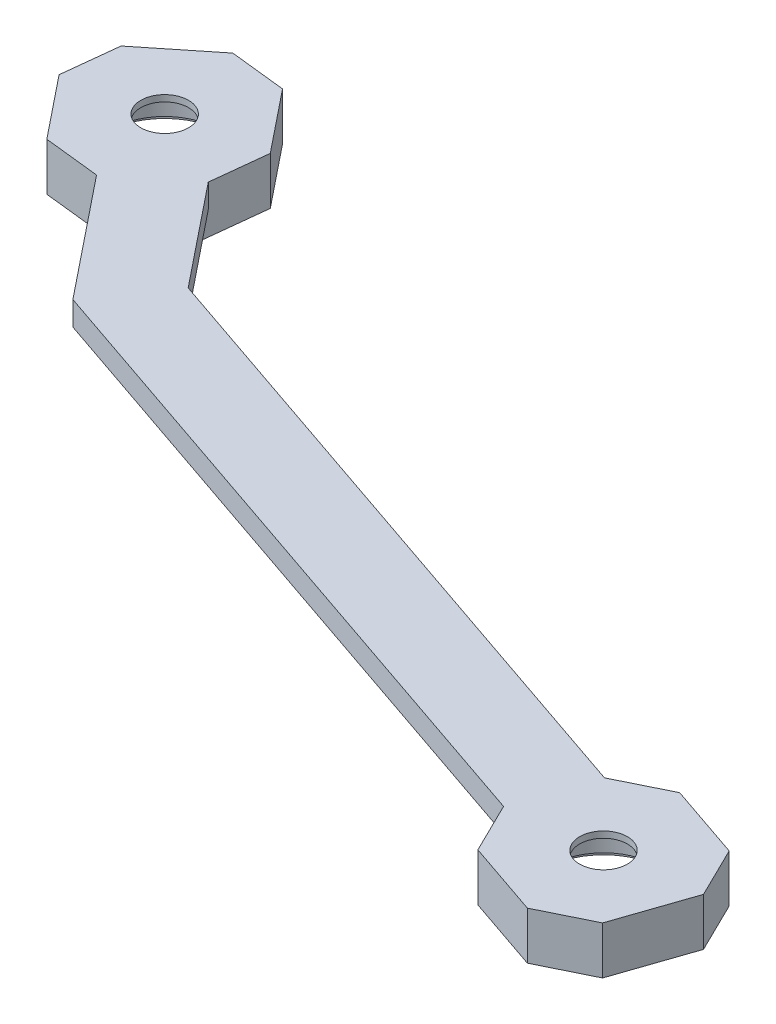
ISO-10303-21;
HEADER;
FILE_DESCRIPTION(('STEP AP214'),'2;1');
FILE_NAME('part.step','',(''),(''),'','','');
FILE_SCHEMA(('AUTOMOTIVE_DESIGN { 1 0 10303 214 1 1 1 1 }'));
ENDSEC;
DATA;
#1=APPLICATION_CONTEXT('core data for automotive mechanical design processes');
#2=APPLICATION_PROTOCOL_DEFINITION('international standard','automotive_design',2000,#1);
#3=PRODUCT_CONTEXT('',#1,'mechanical');
#4=PRODUCT('Part','Part','',(#3));
#5=PRODUCT_RELATED_PRODUCT_CATEGORY('part','',(#4));
#6=PRODUCT_DEFINITION_FORMATION('','',#4);
#7=PRODUCT_DEFINITION_CONTEXT('part definition',#1,'design');
#8=PRODUCT_DEFINITION('design','',#6,#7);
#9=PRODUCT_DEFINITION_SHAPE('','',#8);
#10=(LENGTH_UNIT() NAMED_UNIT(*) SI_UNIT(.MILLI.,.METRE.));
#11=(NAMED_UNIT(*) PLANE_ANGLE_UNIT() SI_UNIT($,.RADIAN.));
#12=(NAMED_UNIT(*) SI_UNIT($,.STERADIAN.) SOLID_ANGLE_UNIT());
#13=UNCERTAINTY_MEASURE_WITH_UNIT(LENGTH_MEASURE(1.E-05),#10,'distance_accuracy_value','');
#14=(GEOMETRIC_REPRESENTATION_CONTEXT(3) GLOBAL_UNCERTAINTY_ASSIGNED_CONTEXT((#13)) GLOBAL_UNIT_ASSIGNED_CONTEXT((#10,
#11,#12)) REPRESENTATION_CONTEXT('',''));
#15=CARTESIAN_POINT('',(0.,0.,0.));
#16=DIRECTION('',(0.,0.,1.));
#17=DIRECTION('',(1.,0.,0.));
#18=AXIS2_PLACEMENT_3D('',#15,#16,#17);
#19=CARTESIAN_POINT('',(134.529659615,-77.500004703,216.370687398));
#20=DIRECTION('',(0.,1.,0.));
#21=DIRECTION('',(-0.958322574538044,0.,0.285688367160398));
#22=AXIS2_PLACEMENT_3D('',#19,#20,#21);
#23=CYLINDRICAL_SURFACE('',#22,3.);
#24=DIRECTION('',(0.,-1.,0.));
#25=VECTOR('',#24,1.);
#26=CARTESIAN_POINT('',(131.654691891,-71.500004703,217.2277525));
#27=LINE('',#26,#25);
#28=CARTESIAN_POINT('',(131.654691891,-71.500004703,217.2277525));
#29=VERTEX_POINT('',#28);
#30=CARTESIAN_POINT('',(131.654691891,-72.300004703,217.2277525));
#31=VERTEX_POINT('',#30);
#32=EDGE_CURVE('E56',#29,#31,#27,.T.);
#33=ORIENTED_EDGE('',*,*,#32,.F.);
#34=CARTESIAN_POINT('',(134.529659615,-71.500004703,216.370687398));
#35=DIRECTION('',(0.,1.,0.));
#36=DIRECTION('',(0.285688367160398,0.,0.958322574538044));
#37=AXIS2_PLACEMENT_3D('',#34,#35,#36);
#38=CIRCLE('',#37,3.);
#39=CARTESIAN_POINT('',(135.386724717,-71.500004703,219.245655121));
#40=VERTEX_POINT('',#39);
#41=EDGE_CURVE('E11',#29,#40,#38,.T.);
#42=ORIENTED_EDGE('',*,*,#41,.T.);
#43=CARTESIAN_POINT('',(134.529659615,-71.500004703,216.370687398));
#44=DIRECTION('',(0.,1.,0.));
#45=DIRECTION('',(0.285688367160398,0.,0.958322574538044));
#46=AXIS2_PLACEMENT_3D('',#43,#44,#45);
#47=CIRCLE('',#46,3.);
#48=EDGE_CURVE('E48',#40,#29,#47,.T.);
#49=ORIENTED_EDGE('',*,*,#48,.T.);
#50=ORIENTED_EDGE('',*,*,#32,.T.);
#51=CARTESIAN_POINT('',(134.529659615,-72.300004703,216.370687398));
#52=DIRECTION('',(0.,1.,0.));
#53=DIRECTION('',(0.285688367160398,0.,0.958322574538044));
#54=AXIS2_PLACEMENT_3D('',#51,#52,#53);
#55=CIRCLE('',#54,3.);
#56=CARTESIAN_POINT('',(135.386724717,-72.300004703,219.245655121));
#57=VERTEX_POINT('',#56);
#58=EDGE_CURVE('E282',#57,#31,#55,.T.);
#59=ORIENTED_EDGE('',*,*,#58,.F.);
#60=CARTESIAN_POINT('',(134.529659615,-72.300004703,216.370687398));
#61=DIRECTION('',(0.,1.,0.));
#62=DIRECTION('',(0.285688367160398,0.,0.958322574538044));
#63=AXIS2_PLACEMENT_3D('',#60,#61,#62);
#64=CIRCLE('',#63,3.);
#65=EDGE_CURVE('E284',#31,#57,#64,.T.);
#66=ORIENTED_EDGE('',*,*,#65,.F.);
#67=EDGE_LOOP('',(#33,#42,#49,#50,#59,#66));
#68=FACE_BOUND('',#67,.T.);
#69=ADVANCED_FACE('F38',(#68),#23,.F.);
#70=CARTESIAN_POINT('',(26.68537969,-77.500004703,163.743590884));
#71=DIRECTION('',(0.,1.,0.));
#72=DIRECTION('',(-0.958322574538044,0.,0.285688367160398));
#73=AXIS2_PLACEMENT_3D('',#70,#71,#72);
#74=CYLINDRICAL_SURFACE('',#73,3.);
#75=DIRECTION('',(0.,-1.,0.));
#76=VECTOR('',#75,1.);
#77=CARTESIAN_POINT('',(23.810411966,-71.500004703,164.600655986));
#78=LINE('',#77,#76);
#79=CARTESIAN_POINT('',(23.810411966,-71.500004703,164.600655986));
#80=VERTEX_POINT('',#79);
#81=CARTESIAN_POINT('',(23.810411966,-72.300004703,164.600655986));
#82=VERTEX_POINT('',#81);
#83=EDGE_CURVE('E271',#80,#82,#78,.T.);
#84=ORIENTED_EDGE('',*,*,#83,.F.);
#85=CARTESIAN_POINT('',(26.68537969,-71.500004703,163.743590884));
#86=DIRECTION('',(0.,1.,0.));
#87=DIRECTION('',(0.285688367160398,0.,0.958322574538044));
#88=AXIS2_PLACEMENT_3D('',#85,#86,#87);
#89=CIRCLE('',#88,3.);
#90=CARTESIAN_POINT('',(27.542444792,-71.500004703,166.618558607));
#91=VERTEX_POINT('',#90);
#92=EDGE_CURVE('E265',#80,#91,#89,.T.);
#93=ORIENTED_EDGE('',*,*,#92,.T.);
#94=CARTESIAN_POINT('',(26.68537969,-71.500004703,163.743590884));
#95=DIRECTION('',(0.,1.,0.));
#96=DIRECTION('',(0.285688367160398,0.,0.958322574538044));
#97=AXIS2_PLACEMENT_3D('',#94,#95,#96);
#98=CIRCLE('',#97,3.);
#99=EDGE_CURVE('E269',#91,#80,#98,.T.);
#100=ORIENTED_EDGE('',*,*,#99,.T.);
#101=ORIENTED_EDGE('',*,*,#83,.T.);
#102=CARTESIAN_POINT('',(26.68537969,-72.300004703,163.743590884));
#103=DIRECTION('',(0.,1.,0.));
#104=DIRECTION('',(0.285688367160398,0.,0.958322574538044));
#105=AXIS2_PLACEMENT_3D('',#102,#103,#104);
#106=CIRCLE('',#105,3.);
#107=CARTESIAN_POINT('',(27.542444792,-72.300004703,166.618558607));
#108=VERTEX_POINT('',#107);
#109=EDGE_CURVE('E323',#108,#82,#106,.T.);
#110=ORIENTED_EDGE('',*,*,#109,.F.);
#111=CARTESIAN_POINT('',(26.68537969,-72.300004703,163.743590884));
#112=DIRECTION('',(0.,1.,0.));
#113=DIRECTION('',(0.285688367160398,0.,0.958322574538044));
#114=AXIS2_PLACEMENT_3D('',#111,#112,#113);
#115=CIRCLE('',#114,3.);
#116=EDGE_CURVE('E350',#82,#108,#115,.T.);
#117=ORIENTED_EDGE('',*,*,#116,.F.);
#118=EDGE_LOOP('',(#84,#93,#100,#101,#110,#117));
#119=FACE_BOUND('',#118,.T.);
#120=ADVANCED_FACE('F267',(#119),#74,.F.);
#121=CARTESIAN_POINT('',(143.183774464,-77.500004703,221.970356688));
#122=DIRECTION('',(0.946261851639749,0.,0.323401465876878));
#123=DIRECTION('',(0.,-1.,0.));
#124=AXIS2_PLACEMENT_3D('',#121,#122,#123);
#125=PLANE('',#124);
#126=DIRECTION('',(-0.323401465876878,0.,0.946261851639749));
#127=VECTOR('',#126,1.);
#128=CARTESIAN_POINT('',(145.609285461,-71.500004703,214.873392802));
#129=LINE('',#128,#127);
#130=CARTESIAN_POINT('',(145.609285461,-71.500004703,214.873392802));
#131=VERTEX_POINT('',#130);
#132=CARTESIAN_POINT('',(142.375270799,-71.500004703,224.336011317));
#133=VERTEX_POINT('',#132);
#134=EDGE_CURVE('E276',#131,#133,#129,.T.);
#135=ORIENTED_EDGE('',*,*,#134,.T.);
#136=DIRECTION('',(0.,1.,0.));
#137=VECTOR('',#136,1.);
#138=CARTESIAN_POINT('',(142.375270799,-77.500004703,224.336011317));
#139=LINE('',#138,#137);
#140=CARTESIAN_POINT('',(142.375270799,-77.500004703,224.336011317));
#141=VERTEX_POINT('',#140);
#142=EDGE_CURVE('E314',#141,#133,#139,.T.);
#143=ORIENTED_EDGE('',*,*,#142,.F.);
#144=DIRECTION('',(-0.323401465876878,0.,0.946261851639749));
#145=VECTOR('',#144,1.);
#146=CARTESIAN_POINT('',(145.609285461,-77.500004703,214.873392802));
#147=LINE('',#146,#145);
#148=CARTESIAN_POINT('',(145.609285461,-77.500004703,214.873392802));
#149=VERTEX_POINT('',#148);
#150=EDGE_CURVE('E298',#149,#141,#147,.T.);
#151=ORIENTED_EDGE('',*,*,#150,.F.);
#152=DIRECTION('',(0.,1.,0.));
#153=VECTOR('',#152,1.);
#154=CARTESIAN_POINT('',(145.609285461,-77.500004703,214.873392802));
#155=LINE('',#154,#153);
#156=EDGE_CURVE('E383',#149,#131,#155,.T.);
#157=ORIENTED_EDGE('',*,*,#156,.T.);
#158=EDGE_LOOP('',(#135,#143,#151,#157));
#159=FACE_BOUND('',#158,.T.);
#160=ADVANCED_FACE('F529',(#159),#125,.T.);
#161=CARTESIAN_POINT('',(144.052134498,-77.500004703,211.699234508));
#162=DIRECTION('',(-0.897787541909522,0.,0.440428801955614));
#163=DIRECTION('',(0.,1.,0.));
#164=AXIS2_PLACEMENT_3D('',#161,#162,#163);
#165=PLANE('',#164);
#166=DIRECTION('',(-0.440428801955614,0.,-0.897787541909522));
#167=VECTOR('',#166,1.);
#168=CARTESIAN_POINT('',(145.609285461,-71.500004703,214.873392802));
#169=LINE('',#168,#167);
#170=CARTESIAN_POINT('',(142.494983534,-71.500004703,208.525076213));
#171=VERTEX_POINT('',#170);
#172=EDGE_CURVE('E483',#131,#171,#169,.T.);
#173=ORIENTED_EDGE('',*,*,#172,.F.);
#174=ORIENTED_EDGE('',*,*,#156,.F.);
#175=DIRECTION('',(-0.440428801955614,0.,-0.897787541909522));
#176=VECTOR('',#175,1.);
#177=CARTESIAN_POINT('',(145.609285461,-77.500004703,214.873392802));
#178=LINE('',#177,#176);
#179=CARTESIAN_POINT('',(142.494983534,-77.500004703,208.525076213));
#180=VERTEX_POINT('',#179);
#181=EDGE_CURVE('E405',#149,#180,#178,.T.);
#182=ORIENTED_EDGE('',*,*,#181,.T.);
#183=DIRECTION('',(0.,1.,0.));
#184=VECTOR('',#183,1.);
#185=CARTESIAN_POINT('',(142.494983534,-77.500004703,208.525076213));
#186=LINE('',#185,#184);
#187=EDGE_CURVE('E408',#180,#171,#186,.T.);
#188=ORIENTED_EDGE('',*,*,#187,.T.);
#189=EDGE_LOOP('',(#173,#174,#182,#188));
#190=FACE_BOUND('',#189,.T.);
#191=ADVANCED_FACE('F533',(#190),#165,.F.);
#192=CARTESIAN_POINT('',(93.930089903,-77.500004703,191.927178093));
#193=DIRECTION('',(-0.323401465876878,0.,0.946261851639749));
#194=DIRECTION('',(0.,1.,0.));
#195=AXIS2_PLACEMENT_3D('',#192,#193,#194);
#196=PLANE('',#195);
#197=DIRECTION('',(-0.946261851639749,0.,-0.323401465876878));
#198=VECTOR('',#197,1.);
#199=CARTESIAN_POINT('',(142.494983534,-71.500004703,208.525076213));
#200=LINE('',#199,#198);
#201=CARTESIAN_POINT('',(133.032365019,-71.500004703,205.291061551));
#202=VERTEX_POINT('',#201);
#203=EDGE_CURVE('E433',#171,#202,#200,.T.);
#204=ORIENTED_EDGE('',*,*,#203,.F.);
#205=ORIENTED_EDGE('',*,*,#187,.F.);
#206=DIRECTION('',(-0.946261851639749,0.,-0.323401465876878));
#207=VECTOR('',#206,1.);
#208=CARTESIAN_POINT('',(142.494983534,-77.500004703,208.525076213));
#209=LINE('',#208,#207);
#210=CARTESIAN_POINT('',(133.032365019,-77.500004703,205.291061551));
#211=VERTEX_POINT('',#210);
#212=EDGE_CURVE('E435',#180,#211,#209,.T.);
#213=ORIENTED_EDGE('',*,*,#212,.T.);
#214=DIRECTION('',(0.,1.,0.));
#215=VECTOR('',#214,1.);
#216=CARTESIAN_POINT('',(133.032365019,-77.500004703,205.291061551));
#217=LINE('',#216,#215);
#218=EDGE_CURVE('E438',#211,#202,#217,.T.);
#219=ORIENTED_EDGE('',*,*,#218,.T.);
#220=EDGE_LOOP('',(#204,#205,#213,#219));
#221=FACE_BOUND('',#220,.T.);
#222=ADVANCED_FACE('F563',(#221),#196,.F.);
#223=CARTESIAN_POINT('',(129.858206725,-77.500004703,206.848212515));
#224=DIRECTION('',(-0.440428801955614,0.,-0.897787541909522));
#225=DIRECTION('',(-0.897787541909522,0.,0.440428801955614));
#226=AXIS2_PLACEMENT_3D('',#223,#224,#225);
#227=PLANE('',#226);
#228=DIRECTION('',(0.897787541909522,0.,-0.440428801955614));
#229=VECTOR('',#228,1.);
#230=CARTESIAN_POINT('',(126.684048431,-71.500004703,208.405363478));
#231=LINE('',#230,#229);
#232=CARTESIAN_POINT('',(126.684048431,-71.500004703,208.405363478));
#233=VERTEX_POINT('',#232);
#234=EDGE_CURVE('E342',#233,#202,#231,.T.);
#235=ORIENTED_EDGE('',*,*,#234,.T.);
#236=ORIENTED_EDGE('',*,*,#218,.F.);
#237=DIRECTION('',(0.897787541909522,0.,-0.440428801955614));
#238=VECTOR('',#237,1.);
#239=CARTESIAN_POINT('',(122.875058477,-77.500004703,210.273944634));
#240=LINE('',#239,#238);
#241=CARTESIAN_POINT('',(122.875058477,-77.500004703,210.273944634));
#242=VERTEX_POINT('',#241);
#243=EDGE_CURVE('E294',#242,#211,#240,.T.);
#244=ORIENTED_EDGE('',*,*,#243,.F.);
#245=DIRECTION('',(-0.733040458262219,-0.577350269206526,0.359608611128637));
#246=VECTOR('',#245,1.);
#247=CARTESIAN_POINT('',(126.684048431,-74.500004703,208.405363478));
#248=LINE('',#247,#246);
#249=CARTESIAN_POINT('',(126.684048431,-74.500004703,208.405363478));
#250=VERTEX_POINT('',#249);
#251=EDGE_CURVE('E486',#250,#242,#248,.T.);
#252=ORIENTED_EDGE('',*,*,#251,.F.);
#253=DIRECTION('',(0.,1.,0.));
#254=VECTOR('',#253,1.);
#255=CARTESIAN_POINT('',(126.684048431,-74.500004703,208.405363478));
#256=LINE('',#255,#254);
#257=EDGE_CURVE('E340',#250,#233,#256,.T.);
#258=ORIENTED_EDGE('',*,*,#257,.T.);
#259=EDGE_LOOP('',(#235,#236,#244,#252,#258));
#260=FACE_BOUND('',#259,.T.);
#261=ADVANCED_FACE('F561',(#260),#227,.T.);
#262=CARTESIAN_POINT('',(47.105158529,-77.500004703,181.207892047));
#263=DIRECTION('',(-0.323401465876878,0.,0.946261851639749));
#264=DIRECTION('',(0.,1.,0.));
#265=AXIS2_PLACEMENT_3D('',#262,#263,#264);
#266=PLANE('',#265);
#267=DIRECTION('',(0.,1.,0.));
#268=VECTOR('',#267,1.);
#269=CARTESIAN_POINT('',(47.105158529,-74.500004703,181.207892047));
#270=LINE('',#269,#268);
#271=CARTESIAN_POINT('',(47.105158529,-74.500004703,181.207892047));
#272=VERTEX_POINT('',#271);
#273=CARTESIAN_POINT('',(47.105158529,-71.500004703,181.207892047));
#274=VERTEX_POINT('',#273);
#275=EDGE_CURVE('E343',#272,#274,#270,.T.);
#276=ORIENTED_EDGE('',*,*,#275,.T.);
#277=DIRECTION('',(-0.946261851639749,0.,-0.323401465876878));
#278=VECTOR('',#277,1.);
#279=CARTESIAN_POINT('',(126.684048431,-71.500004703,208.405363478));
#280=LINE('',#279,#278);
#281=EDGE_CURVE('E431',#233,#274,#280,.T.);
#282=ORIENTED_EDGE('',*,*,#281,.F.);
#283=ORIENTED_EDGE('',*,*,#257,.F.);
#284=DIRECTION('',(0.946261851639749,0.,0.323401465876878));
#285=VECTOR('',#284,1.);
#286=CARTESIAN_POINT('',(47.105158529,-74.500004703,181.207892047));
#287=LINE('',#286,#285);
#288=EDGE_CURVE('E304',#272,#250,#287,.T.);
#289=ORIENTED_EDGE('',*,*,#288,.F.);
#290=EDGE_LOOP('',(#276,#282,#283,#289));
#291=FACE_BOUND('',#290,.T.);
#292=ADVANCED_FACE('F557',(#291),#266,.F.);
#293=CARTESIAN_POINT('',(41.974045084,-77.500004703,174.811557084));
#294=DIRECTION('',(0.780032577131304,0.,-0.625738906105331));
#295=DIRECTION('',(0.,-1.,0.));
#296=AXIS2_PLACEMENT_3D('',#293,#294,#295);
#297=PLANE('',#296);
#298=DIRECTION('',(0.,1.,0.));
#299=VECTOR('',#298,1.);
#300=CARTESIAN_POINT('',(36.842931638,-74.500004703,168.415222122));
#301=LINE('',#300,#299);
#302=CARTESIAN_POINT('',(36.842931638,-74.500004703,168.415222122));
#303=VERTEX_POINT('',#302);
#304=CARTESIAN_POINT('',(36.842931638,-71.500004703,168.415222122));
#305=VERTEX_POINT('',#304);
#306=EDGE_CURVE('E441',#303,#305,#301,.T.);
#307=ORIENTED_EDGE('',*,*,#306,.T.);
#308=DIRECTION('',(0.625738906105331,0.,0.780032577131304));
#309=VECTOR('',#308,1.);
#310=CARTESIAN_POINT('',(36.842931638,-71.500004703,168.415222122));
#311=LINE('',#310,#309);
#312=EDGE_CURVE('E422',#305,#274,#311,.T.);
#313=ORIENTED_EDGE('',*,*,#312,.T.);
#314=ORIENTED_EDGE('',*,*,#275,.F.);
#315=DIRECTION('',(0.625738906105331,0.,0.780032577131304));
#316=VECTOR('',#315,1.);
#317=CARTESIAN_POINT('',(36.842931638,-74.500004703,168.415222122));
#318=LINE('',#317,#316);
#319=EDGE_CURVE('E362',#303,#272,#318,.T.);
#320=ORIENTED_EDGE('',*,*,#319,.F.);
#321=EDGE_LOOP('',(#307,#313,#314,#320));
#322=FACE_BOUND('',#321,.T.);
#323=ADVANCED_FACE('F554',(#322),#297,.T.);
#324=CARTESIAN_POINT('',(37.228665814,-77.500004703,164.900793413));
#325=DIRECTION('',(-0.994030548608424,0.,-0.109102100957022));
#326=DIRECTION('',(-0.109102100957022,0.,0.994030548608424));
#327=AXIS2_PLACEMENT_3D('',#324,#325,#326);
#328=PLANE('',#327);
#329=DIRECTION('',(0.109102100957022,0.,-0.994030548608424));
#330=VECTOR('',#329,1.);
#331=CARTESIAN_POINT('',(36.842931638,-71.500004703,168.415222122));
#332=LINE('',#331,#330);
#333=CARTESIAN_POINT('',(37.614399991,-71.500004703,161.386364705));
#334=VERTEX_POINT('',#333);
#335=EDGE_CURVE('E434',#305,#334,#332,.T.);
#336=ORIENTED_EDGE('',*,*,#335,.F.);
#337=ORIENTED_EDGE('',*,*,#306,.F.);
#338=DIRECTION('',(0.0890814920329446,0.577350269213518,-0.811622544300158));
#339=VECTOR('',#338,1.);
#340=CARTESIAN_POINT('',(36.380050626,-77.500004703,172.632536571));
#341=LINE('',#340,#339);
#342=CARTESIAN_POINT('',(36.380050626,-77.500004703,172.632536571));
#343=VERTEX_POINT('',#342);
#344=EDGE_CURVE('E353',#343,#303,#341,.T.);
#345=ORIENTED_EDGE('',*,*,#344,.F.);
#346=DIRECTION('',(0.109102100957022,0.,-0.994030548608424));
#347=VECTOR('',#346,1.);
#348=CARTESIAN_POINT('',(36.380050626,-77.500004703,172.632536571));
#349=LINE('',#348,#347);
#350=CARTESIAN_POINT('',(37.614399991,-77.500004703,161.386364705));
#351=VERTEX_POINT('',#350);
#352=EDGE_CURVE('E419',#343,#351,#349,.T.);
#353=ORIENTED_EDGE('',*,*,#352,.T.);
#354=DIRECTION('',(0.,1.,0.));
#355=VECTOR('',#354,1.);
#356=CARTESIAN_POINT('',(37.614399991,-77.500004703,161.386364705));
#357=LINE('',#356,#355);
#358=EDGE_CURVE('E375',#351,#334,#357,.T.);
#359=ORIENTED_EDGE('',*,*,#358,.T.);
#360=EDGE_LOOP('',(#336,#337,#345,#353,#359));
#361=FACE_BOUND('',#360,.T.);
#362=ADVANCED_FACE('F657',(#361),#328,.F.);
#363=CARTESIAN_POINT('',(49.476109078,-77.500004703,176.172914515));
#364=DIRECTION('',(0.780032577131304,0.,-0.625738906105331));
#365=DIRECTION('',(0.,-1.,0.));
#366=AXIS2_PLACEMENT_3D('',#363,#364,#365);
#367=PLANE('',#366);
#368=DIRECTION('',(0.625738906105331,0.,0.780032577131304));
#369=VECTOR('',#368,1.);
#370=CARTESIAN_POINT('',(31.357010928,-71.500004703,153.586038936));
#371=LINE('',#370,#369);
#372=CARTESIAN_POINT('',(31.357010928,-71.500004703,153.586038936));
#373=VERTEX_POINT('',#372);
#374=EDGE_CURVE('E338',#373,#334,#371,.T.);
#375=ORIENTED_EDGE('',*,*,#374,.T.);
#376=ORIENTED_EDGE('',*,*,#358,.F.);
#377=DIRECTION('',(0.625738906105331,0.,0.780032577131304));
#378=VECTOR('',#377,1.);
#379=CARTESIAN_POINT('',(31.357010928,-77.500004703,153.586038936));
#380=LINE('',#379,#378);
#381=CARTESIAN_POINT('',(31.357010928,-77.500004703,153.586038936));
#382=VERTEX_POINT('',#381);
#383=EDGE_CURVE('E297',#382,#351,#380,.T.);
#384=ORIENTED_EDGE('',*,*,#383,.F.);
#385=DIRECTION('',(0.,1.,0.));
#386=VECTOR('',#385,1.);
#387=CARTESIAN_POINT('',(31.357010928,-77.500004703,153.586038936));
#388=LINE('',#387,#386);
#389=EDGE_CURVE('E336',#382,#373,#388,.T.);
#390=ORIENTED_EDGE('',*,*,#389,.T.);
#391=EDGE_LOOP('',(#375,#376,#384,#390));
#392=FACE_BOUND('',#391,.T.);
#393=ADVANCED_FACE('F654',(#392),#367,.T.);
#394=CARTESIAN_POINT('',(27.84258222,-77.500004703,153.200304759));
#395=DIRECTION('',(-0.109102100957022,0.,0.994030548608424));
#396=DIRECTION('',(0.,1.,0.));
#397=AXIS2_PLACEMENT_3D('',#394,#395,#396);
#398=PLANE('',#397);
#399=DIRECTION('',(-0.994030548608424,0.,-0.109102100957022));
#400=VECTOR('',#399,1.);
#401=CARTESIAN_POINT('',(31.357010928,-71.500004703,153.586038936));
#402=LINE('',#401,#400);
#403=CARTESIAN_POINT('',(24.328153512,-71.500004703,152.814570582));
#404=VERTEX_POINT('',#403);
#405=EDGE_CURVE('E335',#373,#404,#402,.T.);
#406=ORIENTED_EDGE('',*,*,#405,.F.);
#407=ORIENTED_EDGE('',*,*,#389,.F.);
#408=DIRECTION('',(-0.994030548608424,0.,-0.109102100957022));
#409=VECTOR('',#408,1.);
#410=CARTESIAN_POINT('',(31.357010928,-77.500004703,153.586038936));
#411=LINE('',#410,#409);
#412=CARTESIAN_POINT('',(24.328153512,-77.500004703,152.814570582));
#413=VERTEX_POINT('',#412);
#414=EDGE_CURVE('E339',#382,#413,#411,.T.);
#415=ORIENTED_EDGE('',*,*,#414,.T.);
#416=DIRECTION('',(0.,1.,0.));
#417=VECTOR('',#416,1.);
#418=CARTESIAN_POINT('',(24.328153512,-77.500004703,152.814570582));
#419=LINE('',#418,#417);
#420=EDGE_CURVE('E377',#413,#404,#419,.T.);
#421=ORIENTED_EDGE('',*,*,#420,.T.);
#422=EDGE_LOOP('',(#406,#407,#415,#421));
#423=FACE_BOUND('',#422,.T.);
#424=ADVANCED_FACE('F644',(#423),#398,.F.);
#425=CARTESIAN_POINT('',(22.378072069,-77.500004703,154.378917848));
#426=DIRECTION('',(-0.625738906105331,0.,-0.780032577131304));
#427=DIRECTION('',(-0.780032577131304,0.,0.625738906105331));
#428=AXIS2_PLACEMENT_3D('',#425,#426,#427);
#429=PLANE('',#428);
#430=DIRECTION('',(0.780032577131304,0.,-0.625738906105331));
#431=VECTOR('',#430,1.);
#432=CARTESIAN_POINT('',(16.527827742,-71.500004703,159.071959646));
#433=LINE('',#432,#431);
#434=CARTESIAN_POINT('',(16.527827742,-71.500004703,159.071959646));
#435=VERTEX_POINT('',#434);
#436=EDGE_CURVE('E380',#435,#404,#433,.T.);
#437=ORIENTED_EDGE('',*,*,#436,.T.);
#438=ORIENTED_EDGE('',*,*,#420,.F.);
#439=DIRECTION('',(0.780032577131304,0.,-0.625738906105331));
#440=VECTOR('',#439,1.);
#441=CARTESIAN_POINT('',(16.527827742,-77.500004703,159.071959646));
#442=LINE('',#441,#440);
#443=CARTESIAN_POINT('',(16.527827742,-77.500004703,159.071959646));
#444=VERTEX_POINT('',#443);
#445=EDGE_CURVE('E365',#444,#413,#442,.T.);
#446=ORIENTED_EDGE('',*,*,#445,.F.);
#447=DIRECTION('',(0.,1.,0.));
#448=VECTOR('',#447,1.);
#449=CARTESIAN_POINT('',(16.527827742,-77.500004703,159.071959646));
#450=LINE('',#449,#448);
#451=EDGE_CURVE('E403',#444,#435,#450,.T.);
#452=ORIENTED_EDGE('',*,*,#451,.T.);
#453=EDGE_LOOP('',(#437,#438,#446,#452));
#454=FACE_BOUND('',#453,.T.);
#455=ADVANCED_FACE('F456',(#454),#429,.T.);
#456=CARTESIAN_POINT('',(16.142093565,-77.500004703,162.586388354));
#457=DIRECTION('',(-0.994030548608424,0.,-0.109102100957022));
#458=DIRECTION('',(-0.109102100957022,0.,0.994030548608424));
#459=AXIS2_PLACEMENT_3D('',#456,#457,#458);
#460=PLANE('',#459);
#461=DIRECTION('',(0.109102100957022,0.,-0.994030548608424));
#462=VECTOR('',#461,1.);
#463=CARTESIAN_POINT('',(15.756359389,-71.500004703,166.100817062));
#464=LINE('',#463,#462);
#465=CARTESIAN_POINT('',(15.756359389,-71.500004703,166.100817062));
#466=VERTEX_POINT('',#465);
#467=EDGE_CURVE('E280',#466,#435,#464,.T.);
#468=ORIENTED_EDGE('',*,*,#467,.T.);
#469=ORIENTED_EDGE('',*,*,#451,.F.);
#470=DIRECTION('',(0.109102100957022,0.,-0.994030548608424));
#471=VECTOR('',#470,1.);
#472=CARTESIAN_POINT('',(15.756359389,-77.500004703,166.100817062));
#473=LINE('',#472,#471);
#474=CARTESIAN_POINT('',(15.756359389,-77.500004703,166.100817062));
#475=VERTEX_POINT('',#474);
#476=EDGE_CURVE('E393',#475,#444,#473,.T.);
#477=ORIENTED_EDGE('',*,*,#476,.F.);
#478=DIRECTION('',(0.,1.,0.));
#479=VECTOR('',#478,1.);
#480=CARTESIAN_POINT('',(15.756359389,-77.500004703,166.100817062));
#481=LINE('',#480,#479);
#482=EDGE_CURVE('E446',#475,#466,#481,.T.);
#483=ORIENTED_EDGE('',*,*,#482,.T.);
#484=EDGE_LOOP('',(#468,#469,#477,#483));
#485=FACE_BOUND('',#484,.T.);
#486=ADVANCED_FACE('F460',(#485),#460,.T.);
#487=CARTESIAN_POINT('',(33.875457539,-77.500004703,188.687692642));
#488=DIRECTION('',(0.780032577131304,0.,-0.625738906105331));
#489=DIRECTION('',(0.,-1.,0.));
#490=AXIS2_PLACEMENT_3D('',#487,#488,#489);
#491=PLANE('',#490);
#492=DIRECTION('',(0.625738906105331,0.,0.780032577131304));
#493=VECTOR('',#492,1.);
#494=CARTESIAN_POINT('',(15.756359389,-71.500004703,166.100817062));
#495=LINE('',#494,#493);
#496=CARTESIAN_POINT('',(22.013748452,-71.500004703,173.901142832));
#497=VERTEX_POINT('',#496);
#498=EDGE_CURVE('E329',#466,#497,#495,.T.);
#499=ORIENTED_EDGE('',*,*,#498,.F.);
#500=ORIENTED_EDGE('',*,*,#482,.F.);
#501=DIRECTION('',(0.625738906105331,0.,0.780032577131304));
#502=VECTOR('',#501,1.);
#503=CARTESIAN_POINT('',(15.756359389,-77.500004703,166.100817062));
#504=LINE('',#503,#502);
#505=CARTESIAN_POINT('',(22.013748452,-77.500004703,173.901142832));
#506=VERTEX_POINT('',#505);
#507=EDGE_CURVE('E426',#475,#506,#504,.T.);
#508=ORIENTED_EDGE('',*,*,#507,.T.);
#509=DIRECTION('',(0.,1.,0.));
#510=VECTOR('',#509,1.);
#511=CARTESIAN_POINT('',(22.013748452,-77.500004703,173.901142832));
#512=LINE('',#511,#510);
#513=EDGE_CURVE('E423',#506,#497,#512,.T.);
#514=ORIENTED_EDGE('',*,*,#513,.T.);
#515=EDGE_LOOP('',(#499,#500,#508,#514));
#516=FACE_BOUND('',#515,.T.);
#517=ADVANCED_FACE('F40',(#516),#491,.F.);
#518=CARTESIAN_POINT('',(25.52817716,-77.500004703,174.286877008));
#519=DIRECTION('',(0.109102100957022,0.,-0.994030548608424));
#520=DIRECTION('',(0.,-1.,0.));
#521=AXIS2_PLACEMENT_3D('',#518,#519,#520);
#522=PLANE('',#521);
#523=DIRECTION('',(0.994030548608424,0.,0.109102100957022));
#524=VECTOR('',#523,1.);
#525=CARTESIAN_POINT('',(22.013748452,-71.500004703,173.901142832));
#526=LINE('',#525,#524);
#527=CARTESIAN_POINT('',(29.042605868,-71.500004703,174.672611185));
#528=VERTEX_POINT('',#527);
#529=EDGE_CURVE('E327',#497,#528,#526,.T.);
#530=ORIENTED_EDGE('',*,*,#529,.F.);
#531=ORIENTED_EDGE('',*,*,#513,.F.);
#532=DIRECTION('',(0.994030548608424,0.,0.109102100957022));
#533=VECTOR('',#532,1.);
#534=CARTESIAN_POINT('',(22.013748452,-77.500004703,173.901142832));
#535=LINE('',#534,#533);
#536=CARTESIAN_POINT('',(33.259920318,-77.500004703,175.135492197));
#537=VERTEX_POINT('',#536);
#538=EDGE_CURVE('E326',#506,#537,#535,.T.);
#539=ORIENTED_EDGE('',*,*,#538,.T.);
#540=DIRECTION('',(0.811622544300158,-0.577350269213518,0.0890814920329446));
#541=VECTOR('',#540,1.);
#542=CARTESIAN_POINT('',(29.042605868,-74.500004703,174.672611185));
#543=LINE('',#542,#541);
#544=CARTESIAN_POINT('',(29.042605868,-74.500004703,174.672611185));
#545=VERTEX_POINT('',#544);
#546=EDGE_CURVE('E302',#545,#537,#543,.T.);
#547=ORIENTED_EDGE('',*,*,#546,.F.);
#548=DIRECTION('',(0.,1.,0.));
#549=VECTOR('',#548,1.);
#550=CARTESIAN_POINT('',(29.042605868,-74.500004703,174.672611185));
#551=LINE('',#550,#549);
#552=EDGE_CURVE('E292',#545,#528,#551,.T.);
#553=ORIENTED_EDGE('',*,*,#552,.T.);
#554=EDGE_LOOP('',(#530,#531,#539,#547,#553));
#555=FACE_BOUND('',#554,.T.);
#556=ADVANCED_FACE('F576',(#555),#522,.F.);
#557=CARTESIAN_POINT('',(35.082535199,-77.500004703,182.201856358));
#558=DIRECTION('',(0.780032577131304,0.,-0.625738906105331));
#559=DIRECTION('',(0.,-1.,0.));
#560=AXIS2_PLACEMENT_3D('',#557,#558,#559);
#561=PLANE('',#560);
#562=DIRECTION('',(0.,1.,0.));
#563=VECTOR('',#562,1.);
#564=CARTESIAN_POINT('',(41.122464529,-74.500004703,189.731101532));
#565=LINE('',#564,#563);
#566=CARTESIAN_POINT('',(41.122464529,-74.500004703,189.731101532));
#567=VERTEX_POINT('',#566);
#568=CARTESIAN_POINT('',(41.122464529,-71.500004703,189.731101532));
#569=VERTEX_POINT('',#568);
#570=EDGE_CURVE('E289',#567,#569,#565,.T.);
#571=ORIENTED_EDGE('',*,*,#570,.T.);
#572=DIRECTION('',(0.625738906105331,0.,0.780032577131304));
#573=VECTOR('',#572,1.);
#574=CARTESIAN_POINT('',(29.042605868,-71.500004703,174.672611185));
#575=LINE('',#574,#573);
#576=EDGE_CURVE('E330',#528,#569,#575,.T.);
#577=ORIENTED_EDGE('',*,*,#576,.F.);
#578=ORIENTED_EDGE('',*,*,#552,.F.);
#579=DIRECTION('',(-0.625738906105331,0.,-0.780032577131304));
#580=VECTOR('',#579,1.);
#581=CARTESIAN_POINT('',(41.122464529,-74.500004703,189.731101532));
#582=LINE('',#581,#580);
#583=EDGE_CURVE('E301',#567,#545,#582,.T.);
#584=ORIENTED_EDGE('',*,*,#583,.F.);
#585=EDGE_LOOP('',(#571,#577,#578,#584));
#586=FACE_BOUND('',#585,.T.);
#587=ADVANCED_FACE('F581',(#586),#561,.F.);
#588=CARTESIAN_POINT('',(74.766954061,-77.500004703,201.229691723));
#589=DIRECTION('',(-0.323401465876878,0.,0.946261851639749));
#590=DIRECTION('',(0.,1.,0.));
#591=AXIS2_PLACEMENT_3D('',#588,#589,#590);
#592=PLANE('',#591);
#593=DIRECTION('',(0.,1.,0.));
#594=VECTOR('',#593,1.);
#595=CARTESIAN_POINT('',(123.450033768,-74.500004703,217.867981993));
#596=LINE('',#595,#594);
#597=CARTESIAN_POINT('',(123.450033768,-74.500004703,217.867981993));
#598=VERTEX_POINT('',#597);
#599=CARTESIAN_POINT('',(123.450033768,-71.500004703,217.867981993));
#600=VERTEX_POINT('',#599);
#601=EDGE_CURVE('E293',#598,#600,#596,.T.);
#602=ORIENTED_EDGE('',*,*,#601,.T.);
#603=DIRECTION('',(-0.946261851639749,0.,-0.323401465876878));
#604=VECTOR('',#603,1.);
#605=CARTESIAN_POINT('',(123.450033768,-71.500004703,217.867981993));
#606=LINE('',#605,#604);
#607=EDGE_CURVE('E173',#600,#569,#606,.T.);
#608=ORIENTED_EDGE('',*,*,#607,.T.);
#609=ORIENTED_EDGE('',*,*,#570,.F.);
#610=DIRECTION('',(-0.946261851639749,0.,-0.323401465876878));
#611=VECTOR('',#610,1.);
#612=CARTESIAN_POINT('',(123.450033768,-74.500004703,217.867981993));
#613=LINE('',#612,#611);
#614=EDGE_CURVE('E165',#598,#567,#613,.T.);
#615=ORIENTED_EDGE('',*,*,#614,.F.);
#616=EDGE_LOOP('',(#602,#608,#609,#615));
#617=FACE_BOUND('',#616,.T.);
#618=ADVANCED_FACE('F582',(#617),#592,.T.);
#619=CARTESIAN_POINT('',(125.007184732,-77.500004703,221.042140287));
#620=DIRECTION('',(0.897787541909522,0.,-0.440428801955614));
#621=DIRECTION('',(0.,-1.,0.));
#622=AXIS2_PLACEMENT_3D('',#619,#620,#621);
#623=PLANE('',#622);
#624=DIRECTION('',(0.440428801955614,0.,0.897787541909522));
#625=VECTOR('',#624,1.);
#626=CARTESIAN_POINT('',(123.450033768,-71.500004703,217.867981993));
#627=LINE('',#626,#625);
#628=CARTESIAN_POINT('',(126.564335695,-71.500004703,224.216298582));
#629=VERTEX_POINT('',#628);
#630=EDGE_CURVE('E389',#600,#629,#627,.T.);
#631=ORIENTED_EDGE('',*,*,#630,.F.);
#632=ORIENTED_EDGE('',*,*,#601,.F.);
#633=DIRECTION('',(0.359608611128638,0.577350269206526,0.733040458262219));
#634=VECTOR('',#633,1.);
#635=CARTESIAN_POINT('',(121.581452612,-77.500004703,214.05899204));
#636=LINE('',#635,#634);
#637=CARTESIAN_POINT('',(121.581452612,-77.500004703,214.05899204));
#638=VERTEX_POINT('',#637);
#639=EDGE_CURVE('E287',#638,#598,#636,.T.);
#640=ORIENTED_EDGE('',*,*,#639,.F.);
#641=DIRECTION('',(0.440428801955614,0.,0.897787541909522));
#642=VECTOR('',#641,1.);
#643=CARTESIAN_POINT('',(121.581452612,-77.500004703,214.05899204));
#644=LINE('',#643,#642);
#645=CARTESIAN_POINT('',(126.564335695,-77.500004703,224.216298582));
#646=VERTEX_POINT('',#645);
#647=EDGE_CURVE('E306',#638,#646,#644,.T.);
#648=ORIENTED_EDGE('',*,*,#647,.T.);
#649=DIRECTION('',(0.,1.,0.));
#650=VECTOR('',#649,1.);
#651=CARTESIAN_POINT('',(126.564335695,-77.500004703,224.216298582));
#652=LINE('',#651,#650);
#653=EDGE_CURVE('E309',#646,#629,#652,.T.);
#654=ORIENTED_EDGE('',*,*,#653,.T.);
#655=EDGE_LOOP('',(#631,#632,#640,#648,#654));
#656=FACE_BOUND('',#655,.T.);
#657=ADVANCED_FACE('F583',(#656),#623,.F.);
#658=CARTESIAN_POINT('',(84.713381241,-77.500004703,209.913006093));
#659=DIRECTION('',(-0.323401465876878,0.,0.946261851639749));
#660=DIRECTION('',(0.,1.,0.));
#661=AXIS2_PLACEMENT_3D('',#658,#659,#660);
#662=PLANE('',#661);
#663=DIRECTION('',(-0.946261851639749,0.,-0.323401465876878));
#664=VECTOR('',#663,1.);
#665=CARTESIAN_POINT('',(136.02695421,-71.500004703,227.450313244));
#666=LINE('',#665,#664);
#667=CARTESIAN_POINT('',(136.02695421,-71.500004703,227.450313244));
#668=VERTEX_POINT('',#667);
#669=EDGE_CURVE('E42',#668,#629,#666,.T.);
#670=ORIENTED_EDGE('',*,*,#669,.T.);
#671=ORIENTED_EDGE('',*,*,#653,.F.);
#672=DIRECTION('',(-0.946261851639749,0.,-0.323401465876878));
#673=VECTOR('',#672,1.);
#674=CARTESIAN_POINT('',(136.02695421,-77.500004703,227.450313244));
#675=LINE('',#674,#673);
#676=CARTESIAN_POINT('',(136.02695421,-77.500004703,227.450313244));
#677=VERTEX_POINT('',#676);
#678=EDGE_CURVE('E428',#677,#646,#675,.T.);
#679=ORIENTED_EDGE('',*,*,#678,.F.);
#680=DIRECTION('',(0.,1.,0.));
#681=VECTOR('',#680,1.);
#682=CARTESIAN_POINT('',(136.02695421,-77.500004703,227.450313244));
#683=LINE('',#682,#681);
#684=EDGE_CURVE('E313',#677,#668,#683,.T.);
#685=ORIENTED_EDGE('',*,*,#684,.T.);
#686=EDGE_LOOP('',(#670,#671,#679,#685));
#687=FACE_BOUND('',#686,.T.);
#688=ADVANCED_FACE('F519',(#687),#662,.T.);
#689=CARTESIAN_POINT('',(139.201112505,-77.500004703,225.893162281));
#690=DIRECTION('',(-0.440428801955614,0.,-0.897787541909522));
#691=DIRECTION('',(-0.897787541909522,0.,0.440428801955614));
#692=AXIS2_PLACEMENT_3D('',#689,#690,#691);
#693=PLANE('',#692);
#694=DIRECTION('',(0.897787541909522,0.,-0.440428801955614));
#695=VECTOR('',#694,1.);
#696=CARTESIAN_POINT('',(136.02695421,-71.500004703,227.450313244));
#697=LINE('',#696,#695);
#698=EDGE_CURVE('E345',#668,#133,#697,.T.);
#699=ORIENTED_EDGE('',*,*,#698,.F.);
#700=ORIENTED_EDGE('',*,*,#684,.F.);
#701=DIRECTION('',(0.897787541909522,0.,-0.440428801955614));
#702=VECTOR('',#701,1.);
#703=CARTESIAN_POINT('',(136.02695421,-77.500004703,227.450313244));
#704=LINE('',#703,#702);
#705=EDGE_CURVE('E310',#677,#141,#704,.T.);
#706=ORIENTED_EDGE('',*,*,#705,.T.);
#707=ORIENTED_EDGE('',*,*,#142,.T.);
#708=EDGE_LOOP('',(#699,#700,#706,#707));
#709=FACE_BOUND('',#708,.T.);
#710=ADVANCED_FACE('F525',(#709),#693,.F.);
#711=CARTESIAN_POINT('',(71.925465233,-77.500004703,35.4730383));
#712=DIRECTION('',(0.,-1.,0.));
#713=DIRECTION('',(0.,0.,-1.));
#714=AXIS2_PLACEMENT_3D('',#711,#712,#713);
#715=PLANE('',#714);
#716=CARTESIAN_POINT('',(134.529659615,-77.500004703,216.370687398));
#717=DIRECTION('',(0.,1.,0.));
#718=DIRECTION('',(0.958322574538044,0.,-0.285688367160398));
#719=AXIS2_PLACEMENT_3D('',#716,#717,#718);
#720=CIRCLE('',#719,7.8);
#721=CARTESIAN_POINT('',(142.004575696,-77.500004703,214.142318132));
#722=VERTEX_POINT('',#721);
#723=CARTESIAN_POINT('',(127.054743534,-77.500004703,218.599056663));
#724=VERTEX_POINT('',#723);
#725=EDGE_CURVE('E315',#722,#724,#720,.T.);
#726=ORIENTED_EDGE('',*,*,#725,.T.);
#727=CARTESIAN_POINT('',(134.529659615,-77.500004703,216.370687398));
#728=DIRECTION('',(0.,1.,0.));
#729=DIRECTION('',(0.958322574538044,0.,-0.285688367160398));
#730=AXIS2_PLACEMENT_3D('',#727,#728,#729);
#731=CIRCLE('',#730,7.8);
#732=EDGE_CURVE('E318',#724,#722,#731,.T.);
#733=ORIENTED_EDGE('',*,*,#732,.T.);
#734=EDGE_LOOP('',(#726,#733));
#735=FACE_BOUND('',#734,.T.);
#736=CARTESIAN_POINT('',(26.68537969,-77.500004703,163.743590884));
#737=DIRECTION('',(0.,1.,0.));
#738=DIRECTION('',(0.958322574538044,0.,-0.285688367160398));
#739=AXIS2_PLACEMENT_3D('',#736,#737,#738);
#740=CIRCLE('',#739,7.8);
#741=CARTESIAN_POINT('',(34.160295771,-77.500004703,161.515221618));
#742=VERTEX_POINT('',#741);
#743=CARTESIAN_POINT('',(19.210463609,-77.500004703,165.971960149));
#744=VERTEX_POINT('',#743);
#745=EDGE_CURVE('E333',#742,#744,#740,.T.);
#746=ORIENTED_EDGE('',*,*,#745,.T.);
#747=CARTESIAN_POINT('',(26.68537969,-77.500004703,163.743590884));
#748=DIRECTION('',(0.,1.,0.));
#749=DIRECTION('',(0.958322574538044,0.,-0.285688367160398));
#750=AXIS2_PLACEMENT_3D('',#747,#748,#749);
#751=CIRCLE('',#750,7.8);
#752=EDGE_CURVE('E390',#744,#742,#751,.T.);
#753=ORIENTED_EDGE('',*,*,#752,.T.);
#754=EDGE_LOOP('',(#746,#753));
#755=FACE_BOUND('',#754,.T.);
#756=DIRECTION('',(0.946261851639749,0.,0.323401465876878));
#757=VECTOR('',#756,1.);
#758=CARTESIAN_POINT('',(42.917272729,-77.500004703,187.174138686));
#759=LINE('',#758,#757);
#760=CARTESIAN_POINT('',(42.917272729,-77.500004703,187.174138686));
#761=VERTEX_POINT('',#760);
#762=EDGE_CURVE('E288',#761,#638,#759,.T.);
#763=ORIENTED_EDGE('',*,*,#762,.F.);
#764=DIRECTION('',(0.625738906105331,0.,0.780032577131304));
#765=VECTOR('',#764,1.);
#766=CARTESIAN_POINT('',(33.259920318,-77.500004703,175.135492197));
#767=LINE('',#766,#765);
#768=EDGE_CURVE('E305',#537,#761,#767,.T.);
#769=ORIENTED_EDGE('',*,*,#768,.F.);
#770=ORIENTED_EDGE('',*,*,#538,.F.);
#771=ORIENTED_EDGE('',*,*,#507,.F.);
#772=ORIENTED_EDGE('',*,*,#476,.T.);
#773=ORIENTED_EDGE('',*,*,#445,.T.);
#774=ORIENTED_EDGE('',*,*,#414,.F.);
#775=ORIENTED_EDGE('',*,*,#383,.T.);
#776=ORIENTED_EDGE('',*,*,#352,.F.);
#777=DIRECTION('',(-0.625738906105331,0.,-0.780032577131304));
#778=VECTOR('',#777,1.);
#779=CARTESIAN_POINT('',(45.310350329,-77.500004703,183.764854892));
#780=LINE('',#779,#778);
#781=CARTESIAN_POINT('',(45.310350329,-77.500004703,183.764854892));
#782=VERTEX_POINT('',#781);
#783=EDGE_CURVE('E488',#782,#343,#780,.T.);
#784=ORIENTED_EDGE('',*,*,#783,.F.);
#785=DIRECTION('',(-0.946261851639749,0.,-0.323401465876878));
#786=VECTOR('',#785,1.);
#787=CARTESIAN_POINT('',(122.875058477,-77.500004703,210.273944634));
#788=LINE('',#787,#786);
#789=EDGE_CURVE('E489',#242,#782,#788,.T.);
#790=ORIENTED_EDGE('',*,*,#789,.F.);
#791=ORIENTED_EDGE('',*,*,#243,.T.);
#792=ORIENTED_EDGE('',*,*,#212,.F.);
#793=ORIENTED_EDGE('',*,*,#181,.F.);
#794=ORIENTED_EDGE('',*,*,#150,.T.);
#795=ORIENTED_EDGE('',*,*,#705,.F.);
#796=ORIENTED_EDGE('',*,*,#678,.T.);
#797=ORIENTED_EDGE('',*,*,#647,.F.);
#798=EDGE_LOOP('',(#763,#769,#770,#771,#772,#773,#774,#775,#776,#784,#790,#791,#792,#793,#794,
#795,#796,#797));
#799=FACE_BOUND('',#798,.T.);
#800=ADVANCED_FACE('F451',(#735,#755,#799),#715,.T.);
#801=CARTESIAN_POINT('',(71.925465233,-71.500004703,35.4730383));
#802=DIRECTION('',(0.,-1.,0.));
#803=DIRECTION('',(0.,0.,-1.));
#804=AXIS2_PLACEMENT_3D('',#801,#802,#803);
#805=PLANE('',#804);
#806=ORIENTED_EDGE('',*,*,#134,.F.);
#807=ORIENTED_EDGE('',*,*,#172,.T.);
#808=ORIENTED_EDGE('',*,*,#203,.T.);
#809=ORIENTED_EDGE('',*,*,#234,.F.);
#810=ORIENTED_EDGE('',*,*,#281,.T.);
#811=ORIENTED_EDGE('',*,*,#312,.F.);
#812=ORIENTED_EDGE('',*,*,#335,.T.);
#813=ORIENTED_EDGE('',*,*,#374,.F.);
#814=ORIENTED_EDGE('',*,*,#405,.T.);
#815=ORIENTED_EDGE('',*,*,#436,.F.);
#816=ORIENTED_EDGE('',*,*,#467,.F.);
#817=ORIENTED_EDGE('',*,*,#498,.T.);
#818=ORIENTED_EDGE('',*,*,#529,.T.);
#819=ORIENTED_EDGE('',*,*,#576,.T.);
#820=ORIENTED_EDGE('',*,*,#607,.F.);
#821=ORIENTED_EDGE('',*,*,#630,.T.);
#822=ORIENTED_EDGE('',*,*,#669,.F.);
#823=ORIENTED_EDGE('',*,*,#698,.T.);
#824=EDGE_LOOP('',(#806,#807,#808,#809,#810,#811,#812,#813,#814,#815,#816,#817,#818,#819,#820,
#821,#822,#823));
#825=FACE_BOUND('',#824,.T.);
#826=ORIENTED_EDGE('',*,*,#41,.F.);
#827=ORIENTED_EDGE('',*,*,#48,.F.);
#828=EDGE_LOOP('',(#826,#827));
#829=FACE_BOUND('',#828,.T.);
#830=ORIENTED_EDGE('',*,*,#92,.F.);
#831=ORIENTED_EDGE('',*,*,#99,.F.);
#832=EDGE_LOOP('',(#830,#831));
#833=FACE_BOUND('',#832,.T.);
#834=ADVANCED_FACE('F274',(#825,#829,#833),#805,.F.);
#835=CARTESIAN_POINT('',(26.68537969,-77.500004703,163.743590884));
#836=DIRECTION('',(0.,1.,0.));
#837=DIRECTION('',(-0.958322574538044,0.,0.285688367160398));
#838=AXIS2_PLACEMENT_3D('',#835,#836,#837);
#839=CYLINDRICAL_SURFACE('',#838,7.8);
#840=DIRECTION('',(0.,-1.,0.));
#841=VECTOR('',#840,1.);
#842=CARTESIAN_POINT('',(19.210463609,-76.500004703,165.971960149));
#843=LINE('',#842,#841);
#844=CARTESIAN_POINT('',(19.210463609,-76.500004703,165.971960149));
#845=VERTEX_POINT('',#844);
#846=EDGE_CURVE('E386',#845,#744,#843,.T.);
#847=ORIENTED_EDGE('',*,*,#846,.F.);
#848=CARTESIAN_POINT('',(26.68537969,-76.500004703,163.743590884));
#849=DIRECTION('',(0.,1.,0.));
#850=DIRECTION('',(0.958322574538044,0.,-0.285688367160398));
#851=AXIS2_PLACEMENT_3D('',#848,#849,#850);
#852=CIRCLE('',#851,7.8);
#853=CARTESIAN_POINT('',(34.160295771,-76.500004703,161.515221618));
#854=VERTEX_POINT('',#853);
#855=EDGE_CURVE('E199',#845,#854,#852,.T.);
#856=ORIENTED_EDGE('',*,*,#855,.T.);
#857=CARTESIAN_POINT('',(26.68537969,-76.500004703,163.743590884));
#858=DIRECTION('',(0.,1.,0.));
#859=DIRECTION('',(0.958322574538044,0.,-0.285688367160398));
#860=AXIS2_PLACEMENT_3D('',#857,#858,#859);
#861=CIRCLE('',#860,7.8);
#862=EDGE_CURVE('E346',#854,#845,#861,.T.);
#863=ORIENTED_EDGE('',*,*,#862,.T.);
#864=ORIENTED_EDGE('',*,*,#846,.T.);
#865=ORIENTED_EDGE('',*,*,#745,.F.);
#866=ORIENTED_EDGE('',*,*,#752,.F.);
#867=EDGE_LOOP('',(#847,#856,#863,#864,#865,#866));
#868=FACE_BOUND('',#867,.T.);
#869=ADVANCED_FACE('F652',(#868),#839,.F.);
#870=CARTESIAN_POINT('',(-0.398787476,-76.500004703,-49.902779812));
#871=DIRECTION('',(0.,-1.,0.));
#872=DIRECTION('',(0.,0.,-1.));
#873=AXIS2_PLACEMENT_3D('',#870,#871,#872);
#874=PLANE('',#873);
#875=CARTESIAN_POINT('',(26.68537969,-76.500004703,163.743590884));
#876=DIRECTION('',(0.,1.,0.));
#877=DIRECTION('',(0.958322574538044,0.,-0.285688367160398));
#878=AXIS2_PLACEMENT_3D('',#875,#876,#877);
#879=CIRCLE('',#878,6.7);
#880=CARTESIAN_POINT('',(33.106140939,-76.500004703,161.829478822));
#881=VERTEX_POINT('',#880);
#882=CARTESIAN_POINT('',(20.264618441,-76.500004703,165.657702945));
#883=VERTEX_POINT('',#882);
#884=EDGE_CURVE('E384',#881,#883,#879,.T.);
#885=ORIENTED_EDGE('',*,*,#884,.T.);
#886=CARTESIAN_POINT('',(26.68537969,-76.500004703,163.743590884));
#887=DIRECTION('',(0.,1.,0.));
#888=DIRECTION('',(0.958322574538044,0.,-0.285688367160398));
#889=AXIS2_PLACEMENT_3D('',#886,#887,#888);
#890=CIRCLE('',#889,6.7);
#891=EDGE_CURVE('E208',#883,#881,#890,.T.);
#892=ORIENTED_EDGE('',*,*,#891,.T.);
#893=EDGE_LOOP('',(#885,#892));
#894=FACE_BOUND('',#893,.T.);
#895=ORIENTED_EDGE('',*,*,#855,.F.);
#896=ORIENTED_EDGE('',*,*,#862,.F.);
#897=EDGE_LOOP('',(#895,#896));
#898=FACE_BOUND('',#897,.T.);
#899=ADVANCED_FACE('F649',(#894,#898),#874,.T.);
#900=CARTESIAN_POINT('',(134.529659615,-77.500004703,216.370687398));
#901=DIRECTION('',(0.,1.,0.));
#902=DIRECTION('',(-0.958322574538044,0.,0.285688367160398));
#903=AXIS2_PLACEMENT_3D('',#900,#901,#902);
#904=CYLINDRICAL_SURFACE('',#903,7.8);
#905=DIRECTION('',(0.,-1.,0.));
#906=VECTOR('',#905,1.);
#907=CARTESIAN_POINT('',(127.054743534,-76.500004703,218.599056663));
#908=LINE('',#907,#906);
#909=CARTESIAN_POINT('',(127.054743534,-76.500004703,218.599056663));
#910=VERTEX_POINT('',#909);
#911=EDGE_CURVE('E355',#910,#724,#908,.T.);
#912=ORIENTED_EDGE('',*,*,#911,.F.);
#913=CARTESIAN_POINT('',(134.529659615,-76.500004703,216.370687398));
#914=DIRECTION('',(0.,1.,0.));
#915=DIRECTION('',(0.958322574538044,0.,-0.285688367160398));
#916=AXIS2_PLACEMENT_3D('',#913,#914,#915);
#917=CIRCLE('',#916,7.8);
#918=CARTESIAN_POINT('',(142.004575696,-76.500004703,214.142318132));
#919=VERTEX_POINT('',#918);
#920=EDGE_CURVE('E396',#910,#919,#917,.T.);
#921=ORIENTED_EDGE('',*,*,#920,.T.);
#922=CARTESIAN_POINT('',(134.529659615,-76.500004703,216.370687398));
#923=DIRECTION('',(0.,1.,0.));
#924=DIRECTION('',(0.958322574538044,0.,-0.285688367160398));
#925=AXIS2_PLACEMENT_3D('',#922,#923,#924);
#926=CIRCLE('',#925,7.8);
#927=EDGE_CURVE('E358',#919,#910,#926,.T.);
#928=ORIENTED_EDGE('',*,*,#927,.T.);
#929=ORIENTED_EDGE('',*,*,#911,.T.);
#930=ORIENTED_EDGE('',*,*,#725,.F.);
#931=ORIENTED_EDGE('',*,*,#732,.F.);
#932=EDGE_LOOP('',(#912,#921,#928,#929,#930,#931));
#933=FACE_BOUND('',#932,.T.);
#934=ADVANCED_FACE('F628',(#933),#904,.F.);
#935=CARTESIAN_POINT('',(107.445492449,-76.500004703,2.724316702));
#936=DIRECTION('',(0.,-1.,0.));
#937=DIRECTION('',(0.,0.,-1.));
#938=AXIS2_PLACEMENT_3D('',#935,#936,#937);
#939=PLANE('',#938);
#940=CARTESIAN_POINT('',(134.529659615,-76.500004703,216.370687398));
#941=DIRECTION('',(0.,1.,0.));
#942=DIRECTION('',(0.958322574538044,0.,-0.285688367160398));
#943=AXIS2_PLACEMENT_3D('',#940,#941,#942);
#944=CIRCLE('',#943,6.7);
#945=CARTESIAN_POINT('',(140.950420864,-76.500004703,214.456575336));
#946=VERTEX_POINT('',#945);
#947=CARTESIAN_POINT('',(128.108898366,-76.500004703,218.284799459));
#948=VERTEX_POINT('',#947);
#949=EDGE_CURVE('E359',#946,#948,#944,.T.);
#950=ORIENTED_EDGE('',*,*,#949,.T.);
#951=CARTESIAN_POINT('',(134.529659615,-76.500004703,216.370687398));
#952=DIRECTION('',(0.,1.,0.));
#953=DIRECTION('',(0.958322574538044,0.,-0.285688367160398));
#954=AXIS2_PLACEMENT_3D('',#951,#952,#953);
#955=CIRCLE('',#954,6.7);
#956=EDGE_CURVE('E397',#948,#946,#955,.T.);
#957=ORIENTED_EDGE('',*,*,#956,.T.);
#958=EDGE_LOOP('',(#950,#957));
#959=FACE_BOUND('',#958,.T.);
#960=ORIENTED_EDGE('',*,*,#920,.F.);
#961=ORIENTED_EDGE('',*,*,#927,.F.);
#962=EDGE_LOOP('',(#960,#961));
#963=FACE_BOUND('',#962,.T.);
#964=ADVANCED_FACE('F613',(#959,#963),#939,.T.);
#965=CARTESIAN_POINT('',(134.529659615,-76.500004703,216.370687398));
#966=DIRECTION('',(0.,1.,0.));
#967=DIRECTION('',(-0.958322574538044,0.,0.285688367160398));
#968=AXIS2_PLACEMENT_3D('',#965,#966,#967);
#969=CYLINDRICAL_SURFACE('',#968,6.7);
#970=DIRECTION('',(0.,-1.,0.));
#971=VECTOR('',#970,1.);
#972=CARTESIAN_POINT('',(128.108898366,-72.300004703,218.284799459));
#973=LINE('',#972,#971);
#974=CARTESIAN_POINT('',(128.108898366,-72.300004703,218.284799459));
#975=VERTEX_POINT('',#974);
#976=EDGE_CURVE('E283',#975,#948,#973,.T.);
#977=ORIENTED_EDGE('',*,*,#976,.F.);
#978=CARTESIAN_POINT('',(134.529659615,-72.300004703,216.370687398));
#979=DIRECTION('',(0.,1.,0.));
#980=DIRECTION('',(0.958322574538044,0.,-0.285688367160398));
#981=AXIS2_PLACEMENT_3D('',#978,#979,#980);
#982=CIRCLE('',#981,6.7);
#983=CARTESIAN_POINT('',(140.950420864,-72.300004703,214.456575336));
#984=VERTEX_POINT('',#983);
#985=EDGE_CURVE('E400',#975,#984,#982,.T.);
#986=ORIENTED_EDGE('',*,*,#985,.T.);
#987=CARTESIAN_POINT('',(134.529659615,-72.300004703,216.370687398));
#988=DIRECTION('',(0.,1.,0.));
#989=DIRECTION('',(0.958322574538044,0.,-0.285688367160398));
#990=AXIS2_PLACEMENT_3D('',#987,#988,#989);
#991=CIRCLE('',#990,6.7);
#992=EDGE_CURVE('E349',#984,#975,#991,.T.);
#993=ORIENTED_EDGE('',*,*,#992,.T.);
#994=ORIENTED_EDGE('',*,*,#976,.T.);
#995=ORIENTED_EDGE('',*,*,#949,.F.);
#996=ORIENTED_EDGE('',*,*,#956,.F.);
#997=EDGE_LOOP('',(#977,#986,#993,#994,#995,#996));
#998=FACE_BOUND('',#997,.T.);
#999=ADVANCED_FACE('F608',(#998),#969,.F.);
#1000=CARTESIAN_POINT('',(107.445492449,-72.300004703,2.724316702));
#1001=DIRECTION('',(0.,-1.,0.));
#1002=DIRECTION('',(0.,0.,-1.));
#1003=AXIS2_PLACEMENT_3D('',#1000,#1001,#1002);
#1004=PLANE('',#1003);
#1005=ORIENTED_EDGE('',*,*,#58,.T.);
#1006=ORIENTED_EDGE('',*,*,#65,.T.);
#1007=EDGE_LOOP('',(#1005,#1006));
#1008=FACE_BOUND('',#1007,.T.);
#1009=ORIENTED_EDGE('',*,*,#985,.F.);
#1010=ORIENTED_EDGE('',*,*,#992,.F.);
#1011=EDGE_LOOP('',(#1009,#1010));
#1012=FACE_BOUND('',#1011,.T.);
#1013=ADVANCED_FACE('F604',(#1008,#1012),#1004,.T.);
#1014=CARTESIAN_POINT('',(26.68537969,-76.500004703,163.743590884));
#1015=DIRECTION('',(0.,1.,0.));
#1016=DIRECTION('',(-0.958322574538044,0.,0.285688367160398));
#1017=AXIS2_PLACEMENT_3D('',#1014,#1015,#1016);
#1018=CYLINDRICAL_SURFACE('',#1017,6.7);
#1019=DIRECTION('',(0.,-1.,0.));
#1020=VECTOR('',#1019,1.);
#1021=CARTESIAN_POINT('',(20.264618441,-72.300004703,165.657702945));
#1022=LINE('',#1021,#1020);
#1023=CARTESIAN_POINT('',(20.264618441,-72.300004703,165.657702945));
#1024=VERTEX_POINT('',#1023);
#1025=EDGE_CURVE('E319',#1024,#883,#1022,.T.);
#1026=ORIENTED_EDGE('',*,*,#1025,.F.);
#1027=CARTESIAN_POINT('',(26.68537969,-72.300004703,163.743590884));
#1028=DIRECTION('',(0.,1.,0.));
#1029=DIRECTION('',(0.958322574538044,0.,-0.285688367160398));
#1030=AXIS2_PLACEMENT_3D('',#1027,#1028,#1029);
#1031=CIRCLE('',#1030,6.7);
#1032=CARTESIAN_POINT('',(33.106140939,-72.300004703,161.829478822));
#1033=VERTEX_POINT('',#1032);
#1034=EDGE_CURVE('E369',#1024,#1033,#1031,.T.);
#1035=ORIENTED_EDGE('',*,*,#1034,.T.);
#1036=CARTESIAN_POINT('',(26.68537969,-72.300004703,163.743590884));
#1037=DIRECTION('',(0.,1.,0.));
#1038=DIRECTION('',(0.958322574538044,0.,-0.285688367160398));
#1039=AXIS2_PLACEMENT_3D('',#1036,#1037,#1038);
#1040=CIRCLE('',#1039,6.7);
#1041=EDGE_CURVE('E322',#1033,#1024,#1040,.T.);
#1042=ORIENTED_EDGE('',*,*,#1041,.T.);
#1043=ORIENTED_EDGE('',*,*,#1025,.T.);
#1044=ORIENTED_EDGE('',*,*,#884,.F.);
#1045=ORIENTED_EDGE('',*,*,#891,.F.);
#1046=EDGE_LOOP('',(#1026,#1035,#1042,#1043,#1044,#1045));
#1047=FACE_BOUND('',#1046,.T.);
#1048=ADVANCED_FACE('F607',(#1047),#1018,.F.);
#1049=CARTESIAN_POINT('',(-0.398787476,-72.300004703,-49.902779812));
#1050=DIRECTION('',(0.,-1.,0.));
#1051=DIRECTION('',(0.,0.,-1.));
#1052=AXIS2_PLACEMENT_3D('',#1049,#1050,#1051);
#1053=PLANE('',#1052);
#1054=ORIENTED_EDGE('',*,*,#109,.T.);
#1055=ORIENTED_EDGE('',*,*,#116,.T.);
#1056=EDGE_LOOP('',(#1054,#1055));
#1057=FACE_BOUND('',#1056,.T.);
#1058=ORIENTED_EDGE('',*,*,#1034,.F.);
#1059=ORIENTED_EDGE('',*,*,#1041,.F.);
#1060=EDGE_LOOP('',(#1058,#1059));
#1061=FACE_BOUND('',#1060,.T.);
#1062=ADVANCED_FACE('F623',(#1057,#1061),#1053,.T.);
#1063=CARTESIAN_POINT('',(41.974045084,-74.500004703,174.811557084));
#1064=DIRECTION('',(-0.551566324964118,0.707106780953999,0.442464223971215));
#1065=DIRECTION('',(0.625738906199191,0.,0.78003257705601));
#1066=AXIS2_PLACEMENT_3D('',#1063,#1064,#1065);
#1067=PLANE('',#1066);
#1068=ORIENTED_EDGE('',*,*,#344,.T.);
#1069=ORIENTED_EDGE('',*,*,#319,.T.);
#1070=DIRECTION('',(-0.414389388031988,-0.692646805053467,0.590357382045571));
#1071=VECTOR('',#1070,1.);
#1072=CARTESIAN_POINT('',(47.105158529,-74.500004703,181.207892047));
#1073=LINE('',#1072,#1071);
#1074=EDGE_CURVE('E411',#272,#782,#1073,.T.);
#1075=ORIENTED_EDGE('',*,*,#1074,.T.);
#1076=ORIENTED_EDGE('',*,*,#783,.T.);
#1077=EDGE_LOOP('',(#1068,#1069,#1075,#1076));
#1078=FACE_BOUND('',#1077,.T.);
#1079=ADVANCED_FACE('F549',(#1078),#1067,.F.);
#1080=CARTESIAN_POINT('',(23.761202041,-77.500004703,176.400058202));
#1081=DIRECTION('',(0.228679370018642,-0.707106781057643,-0.669108172054546));
#1082=DIRECTION('',(0.,0.687320942999468,-0.726353854064479));
#1083=AXIS2_PLACEMENT_3D('',#1080,#1081,#1082);
#1084=PLANE('',#1083);
#1085=ORIENTED_EDGE('',*,*,#251,.T.);
#1086=ORIENTED_EDGE('',*,*,#789,.T.);
#1087=ORIENTED_EDGE('',*,*,#1074,.F.);
#1088=ORIENTED_EDGE('',*,*,#288,.T.);
#1089=EDGE_LOOP('',(#1085,#1086,#1087,#1088));
#1090=FACE_BOUND('',#1089,.T.);
#1091=ADVANCED_FACE('F544',(#1090),#1084,.T.);
#1092=CARTESIAN_POINT('',(-19.769404594,-77.500004703,109.030283541));
#1093=DIRECTION('',(-0.551566324964118,-0.707106780953999,0.442464223971215));
#1094=DIRECTION('',(-0.788489848802859,0.615047769148743,0.));
#1095=AXIS2_PLACEMENT_3D('',#1092,#1093,#1094);
#1096=PLANE('',#1095);
#1097=ORIENTED_EDGE('',*,*,#546,.T.);
#1098=ORIENTED_EDGE('',*,*,#768,.T.);
#1099=DIRECTION('',(-0.414389388031988,0.692646805053467,0.590357382045571));
#1100=VECTOR('',#1099,1.);
#1101=CARTESIAN_POINT('',(42.917272729,-77.500004703,187.174138686));
#1102=LINE('',#1101,#1100);
#1103=EDGE_CURVE('E372',#761,#567,#1102,.T.);
#1104=ORIENTED_EDGE('',*,*,#1103,.T.);
#1105=ORIENTED_EDGE('',*,*,#583,.T.);
#1106=EDGE_LOOP('',(#1097,#1098,#1104,#1105));
#1107=FACE_BOUND('',#1106,.T.);
#1108=ADVANCED_FACE('F572',(#1107),#1096,.T.);
#1109=CARTESIAN_POINT('',(74.766954061,-74.500004703,201.229691723));
#1110=DIRECTION('',(0.228679370018642,0.707106781057643,-0.669108172054546));
#1111=DIRECTION('',(-0.946261851441707,0.,-0.323401466456343));
#1112=AXIS2_PLACEMENT_3D('',#1109,#1110,#1111);
#1113=PLANE('',#1112);
#1114=ORIENTED_EDGE('',*,*,#639,.T.);
#1115=ORIENTED_EDGE('',*,*,#614,.T.);
#1116=ORIENTED_EDGE('',*,*,#1103,.F.);
#1117=ORIENTED_EDGE('',*,*,#762,.T.);
#1118=EDGE_LOOP('',(#1114,#1115,#1116,#1117));
#1119=FACE_BOUND('',#1118,.T.);
#1120=ADVANCED_FACE('F569',(#1119),#1113,.F.);
#1121=CLOSED_SHELL('',(#69,#120,#160,#191,#222,#261,#292,#323,#362,#393,#424,#455,#486,#517,
#556,#587,#618,#657,#688,#710,#800,#834,#869,#899,#934,#964,#999,#1013,#1048,#1062,#1079,#1091,
#1108,#1120));
#1122=MANIFOLD_SOLID_BREP('B2',#1121);
#1123=ADVANCED_BREP_SHAPE_REPRESENTATION('',(#18,#1122),#14);
#1124=SHAPE_DEFINITION_REPRESENTATION(#9,#1123);
ENDSEC;
END-ISO-10303-21;
